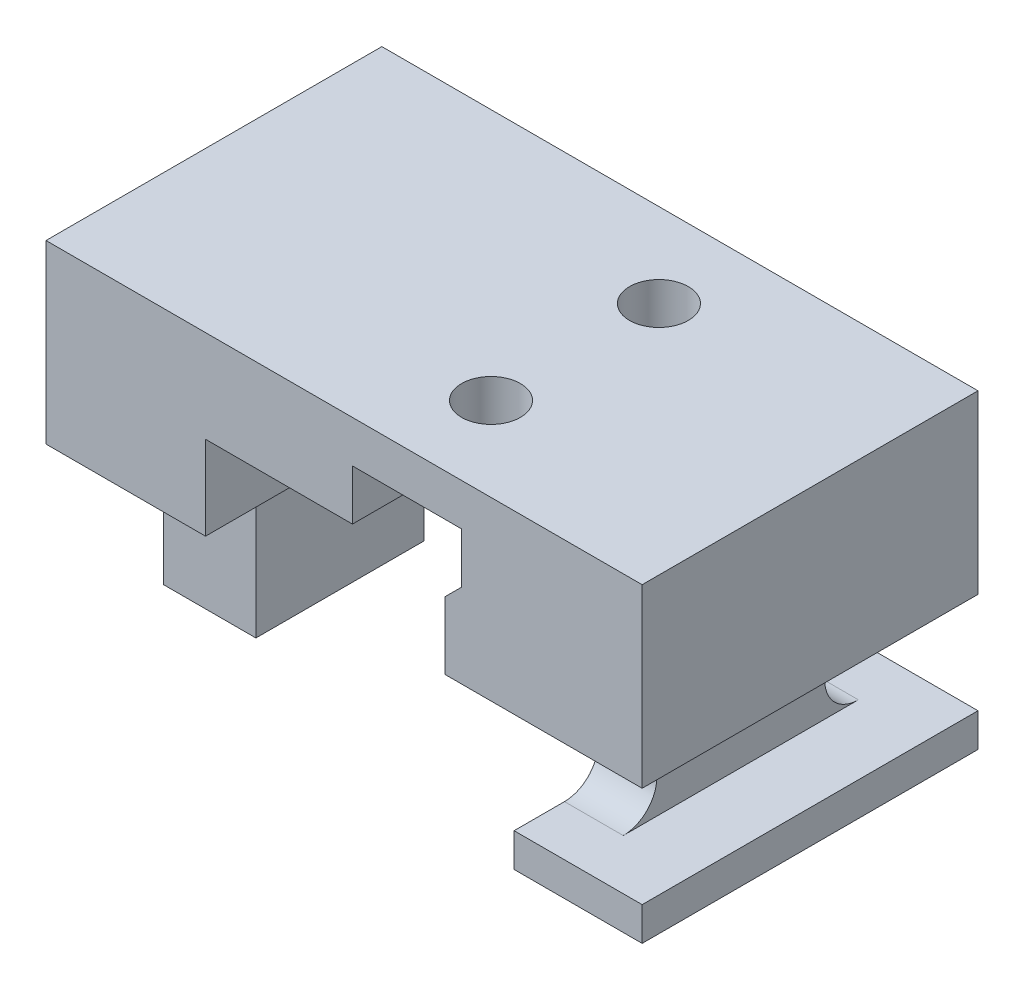
ISO-10303-21;
HEADER;
FILE_DESCRIPTION(('STEP AP214'),'2;1');
FILE_NAME('part.step','',(''),(''),'','','');
FILE_SCHEMA(('AUTOMOTIVE_DESIGN { 1 0 10303 214 1 1 1 1 }'));
ENDSEC;
DATA;
#1=APPLICATION_CONTEXT('core data for automotive mechanical design processes');
#2=APPLICATION_PROTOCOL_DEFINITION('international standard','automotive_design',2000,#1);
#3=PRODUCT_CONTEXT('',#1,'mechanical');
#4=PRODUCT('Part','Part','',(#3));
#5=PRODUCT_RELATED_PRODUCT_CATEGORY('part','',(#4));
#6=PRODUCT_DEFINITION_FORMATION('','',#4);
#7=PRODUCT_DEFINITION_CONTEXT('part definition',#1,'design');
#8=PRODUCT_DEFINITION('design','',#6,#7);
#9=PRODUCT_DEFINITION_SHAPE('','',#8);
#10=(LENGTH_UNIT() NAMED_UNIT(*) SI_UNIT(.MILLI.,.METRE.));
#11=(NAMED_UNIT(*) PLANE_ANGLE_UNIT() SI_UNIT($,.RADIAN.));
#12=(NAMED_UNIT(*) SI_UNIT($,.STERADIAN.) SOLID_ANGLE_UNIT());
#13=UNCERTAINTY_MEASURE_WITH_UNIT(LENGTH_MEASURE(1.E-05),#10,'distance_accuracy_value','');
#14=(GEOMETRIC_REPRESENTATION_CONTEXT(3) GLOBAL_UNCERTAINTY_ASSIGNED_CONTEXT((#13)) GLOBAL_UNIT_ASSIGNED_CONTEXT((#10,
#11,#12)) REPRESENTATION_CONTEXT('',''));
#15=CARTESIAN_POINT('',(0.,0.,0.));
#16=DIRECTION('',(0.,0.,1.));
#17=DIRECTION('',(1.,0.,0.));
#18=AXIS2_PLACEMENT_3D('',#15,#16,#17);
#19=CARTESIAN_POINT('',(-16.75,0.,20.));
#20=DIRECTION('',(1.,0.,0.));
#21=DIRECTION('',(0.,0.,-1.));
#22=AXIS2_PLACEMENT_3D('',#19,#20,#21);
#23=PLANE('',#22);
#24=DIRECTION('',(0.,0.,1.));
#25=VECTOR('',#24,1.);
#26=CARTESIAN_POINT('',(-16.75,-10.5,-10.688779163216));
#27=LINE('',#26,#25);
#28=CARTESIAN_POINT('',(-16.75,-10.5,4.));
#29=VERTEX_POINT('',#28);
#30=CARTESIAN_POINT('',(-16.75,-10.5,16.));
#31=VERTEX_POINT('',#30);
#32=EDGE_CURVE('E304',#29,#31,#27,.T.);
#33=ORIENTED_EDGE('',*,*,#32,.F.);
#34=CARTESIAN_POINT('',(-16.75,-11.5,4.));
#35=DIRECTION('',(1.,0.,0.));
#36=DIRECTION('',(0.,0.,-1.));
#37=AXIS2_PLACEMENT_3D('',#34,#35,#36);
#38=CIRCLE('',#37,1.);
#39=CARTESIAN_POINT('',(-16.75,-11.5,5.));
#40=VERTEX_POINT('',#39);
#41=EDGE_CURVE('E501',#29,#40,#38,.T.);
#42=ORIENTED_EDGE('',*,*,#41,.T.);
#43=DIRECTION('',(0.,1.,0.));
#44=VECTOR('',#43,1.);
#45=CARTESIAN_POINT('',(-16.75,-19.25,5.));
#46=LINE('',#45,#44);
#47=CARTESIAN_POINT('',(-16.75,-19.25,5.));
#48=VERTEX_POINT('',#47);
#49=EDGE_CURVE('E403',#48,#40,#46,.T.);
#50=ORIENTED_EDGE('',*,*,#49,.F.);
#51=DIRECTION('',(0.,0.,-1.));
#52=VECTOR('',#51,1.);
#53=CARTESIAN_POINT('',(-16.75,-19.25,15.));
#54=LINE('',#53,#52);
#55=CARTESIAN_POINT('',(-16.75,-19.25,15.));
#56=VERTEX_POINT('',#55);
#57=EDGE_CURVE('E375',#56,#48,#54,.T.);
#58=ORIENTED_EDGE('',*,*,#57,.F.);
#59=DIRECTION('',(0.,1.,0.));
#60=VECTOR('',#59,1.);
#61=CARTESIAN_POINT('',(-16.75,-19.25,15.));
#62=LINE('',#61,#60);
#63=CARTESIAN_POINT('',(-16.75,-11.5,15.));
#64=VERTEX_POINT('',#63);
#65=EDGE_CURVE('E391',#56,#64,#62,.T.);
#66=ORIENTED_EDGE('',*,*,#65,.T.);
#67=CARTESIAN_POINT('',(-16.75,-11.5,16.));
#68=DIRECTION('',(1.,0.,0.));
#69=DIRECTION('',(0.,0.,-1.));
#70=AXIS2_PLACEMENT_3D('',#67,#68,#69);
#71=CIRCLE('',#70,1.);
#72=EDGE_CURVE('E504',#64,#31,#71,.T.);
#73=ORIENTED_EDGE('',*,*,#72,.T.);
#74=EDGE_LOOP('',(#33,#42,#50,#58,#66,#73));
#75=FACE_BOUND('',#74,.T.);
#76=ADVANCED_FACE('F41',(#75),#23,.F.);
#77=CARTESIAN_POINT('',(5.00000000000001,-10.5,20.));
#78=DIRECTION('',(0.,1.,0.));
#79=DIRECTION('',(0.,0.,1.));
#80=AXIS2_PLACEMENT_3D('',#77,#78,#79);
#81=PLANE('',#80);
#82=DIRECTION('',(1.,0.,0.));
#83=VECTOR('',#82,1.);
#84=CARTESIAN_POINT('',(5.00000000000001,-10.5,0.));
#85=LINE('',#84,#83);
#86=CARTESIAN_POINT('',(5.00000000000001,-10.5,0.));
#87=VERTEX_POINT('',#86);
#88=CARTESIAN_POINT('',(16.75,-10.5,0.));
#89=VERTEX_POINT('',#88);
#90=EDGE_CURVE('E446',#87,#89,#85,.T.);
#91=ORIENTED_EDGE('',*,*,#90,.T.);
#92=DIRECTION('',(0.,0.,-1.));
#93=VECTOR('',#92,1.);
#94=CARTESIAN_POINT('',(16.75,-10.5,20.));
#95=LINE('',#94,#93);
#96=CARTESIAN_POINT('',(16.75,-10.5,20.));
#97=VERTEX_POINT('',#96);
#98=EDGE_CURVE('E459',#97,#89,#95,.T.);
#99=ORIENTED_EDGE('',*,*,#98,.F.);
#100=DIRECTION('',(1.,0.,0.));
#101=VECTOR('',#100,1.);
#102=CARTESIAN_POINT('',(5.00000000000001,-10.5,20.));
#103=LINE('',#102,#101);
#104=CARTESIAN_POINT('',(5.00000000000001,-10.5,20.));
#105=VERTEX_POINT('',#104);
#106=EDGE_CURVE('E426',#105,#97,#103,.T.);
#107=ORIENTED_EDGE('',*,*,#106,.F.);
#108=DIRECTION('',(0.,0.,-1.));
#109=VECTOR('',#108,1.);
#110=CARTESIAN_POINT('',(5.00000000000001,-10.5,20.));
#111=LINE('',#110,#109);
#112=EDGE_CURVE('E462',#105,#87,#111,.T.);
#113=ORIENTED_EDGE('',*,*,#112,.T.);
#114=EDGE_LOOP('',(#91,#99,#107,#113));
#115=FACE_BOUND('',#114,.T.);
#116=DIRECTION('',(-1.,0.,0.));
#117=VECTOR('',#116,1.);
#118=CARTESIAN_POINT('',(9.12499999999999,-10.5,4.));
#119=LINE('',#118,#117);
#120=CARTESIAN_POINT('',(12.625,-10.5,4.));
#121=VERTEX_POINT('',#120);
#122=CARTESIAN_POINT('',(9.12499999999999,-10.5,4.));
#123=VERTEX_POINT('',#122);
#124=EDGE_CURVE('E486',#121,#123,#119,.T.);
#125=ORIENTED_EDGE('',*,*,#124,.T.);
#126=DIRECTION('',(0.,0.,1.));
#127=VECTOR('',#126,1.);
#128=CARTESIAN_POINT('',(9.12499999999999,-10.5,5.));
#129=LINE('',#128,#127);
#130=CARTESIAN_POINT('',(9.12499999999999,-10.5,16.));
#131=VERTEX_POINT('',#130);
#132=EDGE_CURVE('E362',#123,#131,#129,.T.);
#133=ORIENTED_EDGE('',*,*,#132,.T.);
#134=DIRECTION('',(-1.,0.,0.));
#135=VECTOR('',#134,1.);
#136=CARTESIAN_POINT('',(5.00000000000001,-10.5,16.));
#137=LINE('',#136,#135);
#138=CARTESIAN_POINT('',(12.625,-10.5,16.));
#139=VERTEX_POINT('',#138);
#140=EDGE_CURVE('E482',#131,#139,#137,.F.);
#141=ORIENTED_EDGE('',*,*,#140,.T.);
#142=DIRECTION('',(0.,0.,1.));
#143=VECTOR('',#142,1.);
#144=CARTESIAN_POINT('',(12.625,-10.5,5.));
#145=LINE('',#144,#143);
#146=EDGE_CURVE('E366',#121,#139,#145,.T.);
#147=ORIENTED_EDGE('',*,*,#146,.F.);
#148=EDGE_LOOP('',(#125,#133,#141,#147));
#149=FACE_BOUND('',#148,.T.);
#150=ADVANCED_FACE('F589',(#115,#149),#81,.F.);
#151=CARTESIAN_POINT('',(-16.75,-10.5,20.));
#152=DIRECTION('',(0.,1.,0.));
#153=DIRECTION('',(0.,0.,1.));
#154=AXIS2_PLACEMENT_3D('',#151,#152,#153);
#155=PLANE('',#154);
#156=DIRECTION('',(1.,0.,0.));
#157=VECTOR('',#156,1.);
#158=CARTESIAN_POINT('',(-16.75,-10.5,0.));
#159=LINE('',#158,#157);
#160=CARTESIAN_POINT('',(-18.75,-10.5,0.));
#161=VERTEX_POINT('',#160);
#162=CARTESIAN_POINT('',(-9.25,-10.5,0.));
#163=VERTEX_POINT('',#162);
#164=EDGE_CURVE('E415',#161,#163,#159,.T.);
#165=ORIENTED_EDGE('',*,*,#164,.T.);
#166=DIRECTION('',(0.,0.,1.));
#167=VECTOR('',#166,1.);
#168=CARTESIAN_POINT('',(-9.25,-10.5,20.));
#169=LINE('',#168,#167);
#170=CARTESIAN_POINT('',(-9.25,-10.5,20.));
#171=VERTEX_POINT('',#170);
#172=EDGE_CURVE('E272',#163,#171,#169,.T.);
#173=ORIENTED_EDGE('',*,*,#172,.T.);
#174=DIRECTION('',(1.,0.,0.));
#175=VECTOR('',#174,1.);
#176=CARTESIAN_POINT('',(-16.75,-10.5,20.));
#177=LINE('',#176,#175);
#178=CARTESIAN_POINT('',(-18.75,-10.5,20.));
#179=VERTEX_POINT('',#178);
#180=EDGE_CURVE('E416',#179,#171,#177,.T.);
#181=ORIENTED_EDGE('',*,*,#180,.F.);
#182=DIRECTION('',(0.,0.,1.));
#183=VECTOR('',#182,1.);
#184=CARTESIAN_POINT('',(-18.75,-10.5,-10.688779163216));
#185=LINE('',#184,#183);
#186=EDGE_CURVE('E299',#161,#179,#185,.T.);
#187=ORIENTED_EDGE('',*,*,#186,.F.);
#188=EDGE_LOOP('',(#165,#173,#181,#187));
#189=FACE_BOUND('',#188,.T.);
#190=DIRECTION('',(0.,0.,-1.));
#191=VECTOR('',#190,1.);
#192=CARTESIAN_POINT('',(-11.25,-10.5,20.));
#193=LINE('',#192,#191);
#194=CARTESIAN_POINT('',(-11.25,-10.5,16.));
#195=VERTEX_POINT('',#194);
#196=CARTESIAN_POINT('',(-11.25,-10.5,4.));
#197=VERTEX_POINT('',#196);
#198=EDGE_CURVE('E267',#195,#197,#193,.T.);
#199=ORIENTED_EDGE('',*,*,#198,.T.);
#200=DIRECTION('',(1.,0.,0.));
#201=VECTOR('',#200,1.);
#202=CARTESIAN_POINT('',(-16.75,-10.5,4.));
#203=LINE('',#202,#201);
#204=EDGE_CURVE('E470',#197,#29,#203,.F.);
#205=ORIENTED_EDGE('',*,*,#204,.T.);
#206=ORIENTED_EDGE('',*,*,#32,.T.);
#207=DIRECTION('',(-1.,0.,0.));
#208=VECTOR('',#207,1.);
#209=CARTESIAN_POINT('',(-11.25,-10.5,16.));
#210=LINE('',#209,#208);
#211=EDGE_CURVE('E478',#31,#195,#210,.F.);
#212=ORIENTED_EDGE('',*,*,#211,.T.);
#213=EDGE_LOOP('',(#199,#205,#206,#212));
#214=FACE_BOUND('',#213,.T.);
#215=ADVANCED_FACE('F638',(#189,#214),#155,.F.);
#216=CARTESIAN_POINT('',(-11.25,-10.5,20.));
#217=DIRECTION('',(-1.,0.,0.));
#218=DIRECTION('',(0.,0.,1.));
#219=AXIS2_PLACEMENT_3D('',#216,#217,#218);
#220=PLANE('',#219);
#221=CARTESIAN_POINT('',(-11.25,-11.5,4.));
#222=DIRECTION('',(-1.,0.,0.));
#223=DIRECTION('',(0.,0.,1.));
#224=AXIS2_PLACEMENT_3D('',#221,#222,#223);
#225=CIRCLE('',#224,1.);
#226=CARTESIAN_POINT('',(-11.25,-11.5,5.));
#227=VERTEX_POINT('',#226);
#228=EDGE_CURVE('E498',#227,#197,#225,.T.);
#229=ORIENTED_EDGE('',*,*,#228,.T.);
#230=ORIENTED_EDGE('',*,*,#198,.F.);
#231=CARTESIAN_POINT('',(-11.25,-11.5,16.));
#232=DIRECTION('',(-1.,0.,0.));
#233=DIRECTION('',(0.,0.,1.));
#234=AXIS2_PLACEMENT_3D('',#231,#232,#233);
#235=CIRCLE('',#234,1.);
#236=CARTESIAN_POINT('',(-11.25,-11.5,15.));
#237=VERTEX_POINT('',#236);
#238=EDGE_CURVE('E508',#195,#237,#235,.T.);
#239=ORIENTED_EDGE('',*,*,#238,.T.);
#240=DIRECTION('',(0.,1.,0.));
#241=VECTOR('',#240,1.);
#242=CARTESIAN_POINT('',(-11.25,-19.25,15.));
#243=LINE('',#242,#241);
#244=CARTESIAN_POINT('',(-11.25,-19.25,15.));
#245=VERTEX_POINT('',#244);
#246=EDGE_CURVE('E395',#245,#237,#243,.T.);
#247=ORIENTED_EDGE('',*,*,#246,.F.);
#248=DIRECTION('',(0.,0.,1.));
#249=VECTOR('',#248,1.);
#250=CARTESIAN_POINT('',(-11.25,-19.25,15.));
#251=LINE('',#250,#249);
#252=CARTESIAN_POINT('',(-11.25,-19.25,5.));
#253=VERTEX_POINT('',#252);
#254=EDGE_CURVE('E385',#253,#245,#251,.T.);
#255=ORIENTED_EDGE('',*,*,#254,.F.);
#256=DIRECTION('',(0.,1.,0.));
#257=VECTOR('',#256,1.);
#258=CARTESIAN_POINT('',(-11.25,-19.25,5.));
#259=LINE('',#258,#257);
#260=EDGE_CURVE('E399',#253,#227,#259,.T.);
#261=ORIENTED_EDGE('',*,*,#260,.T.);
#262=EDGE_LOOP('',(#229,#230,#239,#247,#255,#261));
#263=FACE_BOUND('',#262,.T.);
#264=ADVANCED_FACE('F757',(#263),#220,.F.);
#265=CARTESIAN_POINT('',(-11.25,-5.5,20.));
#266=DIRECTION('',(0.,1.,0.));
#267=DIRECTION('',(0.,0.,1.));
#268=AXIS2_PLACEMENT_3D('',#265,#266,#267);
#269=PLANE('',#268);
#270=DIRECTION('',(1.,0.,0.));
#271=VECTOR('',#270,1.);
#272=CARTESIAN_POINT('',(-11.25,-5.5,20.));
#273=LINE('',#272,#271);
#274=CARTESIAN_POINT('',(-9.25,-5.5,20.));
#275=VERTEX_POINT('',#274);
#276=CARTESIAN_POINT('',(-0.500000000000008,-5.5,20.));
#277=VERTEX_POINT('',#276);
#278=EDGE_CURVE('E419',#275,#277,#273,.T.);
#279=ORIENTED_EDGE('',*,*,#278,.F.);
#280=DIRECTION('',(0.,0.,1.));
#281=VECTOR('',#280,1.);
#282=CARTESIAN_POINT('',(-9.25,-5.49999999999999,20.));
#283=LINE('',#282,#281);
#284=CARTESIAN_POINT('',(-9.25,-5.5,0.));
#285=VERTEX_POINT('',#284);
#286=EDGE_CURVE('E282',#285,#275,#283,.T.);
#287=ORIENTED_EDGE('',*,*,#286,.F.);
#288=DIRECTION('',(1.,0.,0.));
#289=VECTOR('',#288,1.);
#290=CARTESIAN_POINT('',(-11.25,-5.5,0.));
#291=LINE('',#290,#289);
#292=CARTESIAN_POINT('',(-0.500000000000008,-5.5,0.));
#293=VERTEX_POINT('',#292);
#294=EDGE_CURVE('E440',#285,#293,#291,.T.);
#295=ORIENTED_EDGE('',*,*,#294,.T.);
#296=DIRECTION('',(0.,0.,1.));
#297=VECTOR('',#296,1.);
#298=CARTESIAN_POINT('',(-0.500000000000008,-5.5,-10.));
#299=LINE('',#298,#297);
#300=EDGE_CURVE('E326',#293,#277,#299,.T.);
#301=ORIENTED_EDGE('',*,*,#300,.T.);
#302=EDGE_LOOP('',(#279,#287,#295,#301));
#303=FACE_BOUND('',#302,.T.);
#304=ADVANCED_FACE('F751',(#303),#269,.F.);
#305=CARTESIAN_POINT('',(5.00000000000001,-5.49999999999999,20.));
#306=DIRECTION('',(1.,0.,0.));
#307=DIRECTION('',(0.,1.,0.));
#308=AXIS2_PLACEMENT_3D('',#305,#306,#307);
#309=PLANE('',#308);
#310=DIRECTION('',(0.,-1.,0.));
#311=VECTOR('',#310,1.);
#312=CARTESIAN_POINT('',(4.99999999999999,-3.49999999999999,20.));
#313=LINE('',#312,#311);
#314=CARTESIAN_POINT('',(5.00000000000002,-6.5,20.));
#315=VERTEX_POINT('',#314);
#316=EDGE_CURVE('E423',#315,#105,#313,.T.);
#317=ORIENTED_EDGE('',*,*,#316,.F.);
#318=DIRECTION('',(0.,0.,-1.));
#319=VECTOR('',#318,1.);
#320=CARTESIAN_POINT('',(5.00000000000001,-6.5,20.));
#321=LINE('',#320,#319);
#322=CARTESIAN_POINT('',(5.00000000000001,-6.5,0.));
#323=VERTEX_POINT('',#322);
#324=EDGE_CURVE('E537',#315,#323,#321,.T.);
#325=ORIENTED_EDGE('',*,*,#324,.T.);
#326=DIRECTION('',(0.,-1.,0.));
#327=VECTOR('',#326,1.);
#328=CARTESIAN_POINT('',(5.00000000000001,-5.49999999999999,0.));
#329=LINE('',#328,#327);
#330=EDGE_CURVE('E443',#323,#87,#329,.T.);
#331=ORIENTED_EDGE('',*,*,#330,.T.);
#332=ORIENTED_EDGE('',*,*,#112,.F.);
#333=EDGE_LOOP('',(#317,#325,#331,#332));
#334=FACE_BOUND('',#333,.T.);
#335=ADVANCED_FACE('F756',(#334),#309,.F.);
#336=CARTESIAN_POINT('',(16.75,0.,20.));
#337=DIRECTION('',(1.,0.,0.));
#338=DIRECTION('',(0.,0.,-1.));
#339=AXIS2_PLACEMENT_3D('',#336,#337,#338);
#340=PLANE('',#339);
#341=DIRECTION('',(0.,-1.,0.));
#342=VECTOR('',#341,1.);
#343=CARTESIAN_POINT('',(16.75,0.,0.));
#344=LINE('',#343,#342);
#345=CARTESIAN_POINT('',(16.75,0.,0.));
#346=VERTEX_POINT('',#345);
#347=EDGE_CURVE('E450',#346,#89,#344,.T.);
#348=ORIENTED_EDGE('',*,*,#347,.F.);
#349=DIRECTION('',(0.,0.,-1.));
#350=VECTOR('',#349,1.);
#351=CARTESIAN_POINT('',(16.75,0.,20.));
#352=LINE('',#351,#350);
#353=CARTESIAN_POINT('',(16.75,0.,20.));
#354=VERTEX_POINT('',#353);
#355=EDGE_CURVE('E437',#354,#346,#352,.T.);
#356=ORIENTED_EDGE('',*,*,#355,.F.);
#357=DIRECTION('',(0.,-1.,0.));
#358=VECTOR('',#357,1.);
#359=CARTESIAN_POINT('',(16.75,0.,20.));
#360=LINE('',#359,#358);
#361=EDGE_CURVE('E429',#354,#97,#360,.T.);
#362=ORIENTED_EDGE('',*,*,#361,.T.);
#363=ORIENTED_EDGE('',*,*,#98,.T.);
#364=EDGE_LOOP('',(#348,#356,#362,#363));
#365=FACE_BOUND('',#364,.T.);
#366=ADVANCED_FACE('F794',(#365),#340,.T.);
#367=CARTESIAN_POINT('',(-16.75,0.,20.));
#368=DIRECTION('',(0.,1.,0.));
#369=DIRECTION('',(0.,0.,1.));
#370=AXIS2_PLACEMENT_3D('',#367,#368,#369);
#371=PLANE('',#370);
#372=CARTESIAN_POINT('',(2.74999999999999,0.,5.));
#373=DIRECTION('',(0.,1.,0.));
#374=DIRECTION('',(0.,0.,1.));
#375=AXIS2_PLACEMENT_3D('',#372,#373,#374);
#376=CIRCLE('',#375,1.75);
#377=CARTESIAN_POINT('',(2.74999999999999,0.,6.75));
#378=VERTEX_POINT('',#377);
#379=EDGE_CURVE('E407',#378,#378,#376,.F.);
#380=ORIENTED_EDGE('',*,*,#379,.T.);
#381=EDGE_LOOP('',(#380));
#382=FACE_BOUND('',#381,.T.);
#383=CARTESIAN_POINT('',(2.74999999999999,0.,15.));
#384=DIRECTION('',(0.,1.,0.));
#385=DIRECTION('',(0.,0.,1.));
#386=AXIS2_PLACEMENT_3D('',#383,#384,#385);
#387=CIRCLE('',#386,1.75);
#388=CARTESIAN_POINT('',(2.74999999999999,0.,16.75));
#389=VERTEX_POINT('',#388);
#390=EDGE_CURVE('E411',#389,#389,#387,.F.);
#391=ORIENTED_EDGE('',*,*,#390,.T.);
#392=EDGE_LOOP('',(#391));
#393=FACE_BOUND('',#392,.T.);
#394=DIRECTION('',(1.,0.,0.));
#395=VECTOR('',#394,1.);
#396=CARTESIAN_POINT('',(-16.75,0.,0.));
#397=LINE('',#396,#395);
#398=CARTESIAN_POINT('',(-18.75,0.,0.));
#399=VERTEX_POINT('',#398);
#400=EDGE_CURVE('E420',#399,#346,#397,.T.);
#401=ORIENTED_EDGE('',*,*,#400,.F.);
#402=DIRECTION('',(0.,0.,1.));
#403=VECTOR('',#402,1.);
#404=CARTESIAN_POINT('',(-18.75,0.,-10.688779163216));
#405=LINE('',#404,#403);
#406=CARTESIAN_POINT('',(-18.75,0.,20.));
#407=VERTEX_POINT('',#406);
#408=EDGE_CURVE('E303',#399,#407,#405,.T.);
#409=ORIENTED_EDGE('',*,*,#408,.T.);
#410=DIRECTION('',(1.,0.,0.));
#411=VECTOR('',#410,1.);
#412=CARTESIAN_POINT('',(-16.75,0.,20.));
#413=LINE('',#412,#411);
#414=EDGE_CURVE('E433',#407,#354,#413,.T.);
#415=ORIENTED_EDGE('',*,*,#414,.T.);
#416=ORIENTED_EDGE('',*,*,#355,.T.);
#417=EDGE_LOOP('',(#401,#409,#415,#416));
#418=FACE_BOUND('',#417,.T.);
#419=ADVANCED_FACE('F742',(#382,#393,#418),#371,.T.);
#420=CARTESIAN_POINT('',(0.,0.,20.));
#421=DIRECTION('',(0.,0.,1.));
#422=DIRECTION('',(1.,0.,0.));
#423=AXIS2_PLACEMENT_3D('',#420,#421,#422);
#424=PLANE('',#423);
#425=DIRECTION('',(0.,-1.,0.));
#426=VECTOR('',#425,1.);
#427=CARTESIAN_POINT('',(-9.25,14.5997512422418,20.));
#428=LINE('',#427,#426);
#429=EDGE_CURVE('E286',#275,#171,#428,.T.);
#430=ORIENTED_EDGE('',*,*,#429,.F.);
#431=ORIENTED_EDGE('',*,*,#278,.T.);
#432=DIRECTION('',(0.,-1.,0.));
#433=VECTOR('',#432,1.);
#434=CARTESIAN_POINT('',(-0.500000000000008,-2.5,20.));
#435=LINE('',#434,#433);
#436=CARTESIAN_POINT('',(-0.500000000000008,-2.5,20.));
#437=VERTEX_POINT('',#436);
#438=EDGE_CURVE('E298',#437,#277,#435,.T.);
#439=ORIENTED_EDGE('',*,*,#438,.F.);
#440=DIRECTION('',(-1.,0.,0.));
#441=VECTOR('',#440,1.);
#442=CARTESIAN_POINT('',(-0.500000000000008,-2.5,20.));
#443=LINE('',#442,#441);
#444=CARTESIAN_POINT('',(5.99999999999999,-2.5,20.));
#445=VERTEX_POINT('',#444);
#446=EDGE_CURVE('E322',#445,#437,#443,.T.);
#447=ORIENTED_EDGE('',*,*,#446,.F.);
#448=DIRECTION('',(0.,1.,0.));
#449=VECTOR('',#448,1.);
#450=CARTESIAN_POINT('',(5.99999999999999,-2.5,20.));
#451=LINE('',#450,#449);
#452=CARTESIAN_POINT('',(5.99999999999999,-5.5,20.));
#453=VERTEX_POINT('',#452);
#454=EDGE_CURVE('E318',#453,#445,#451,.T.);
#455=ORIENTED_EDGE('',*,*,#454,.F.);
#456=DIRECTION('',(0.707106781186547,0.707106781186548,0.));
#457=VECTOR('',#456,1.);
#458=CARTESIAN_POINT('',(5.75000000000001,-5.75,20.));
#459=LINE('',#458,#457);
#460=EDGE_CURVE('E308',#453,#315,#459,.F.);
#461=ORIENTED_EDGE('',*,*,#460,.T.);
#462=ORIENTED_EDGE('',*,*,#316,.T.);
#463=ORIENTED_EDGE('',*,*,#106,.T.);
#464=ORIENTED_EDGE('',*,*,#361,.F.);
#465=ORIENTED_EDGE('',*,*,#414,.F.);
#466=DIRECTION('',(0.,-1.,0.));
#467=VECTOR('',#466,1.);
#468=CARTESIAN_POINT('',(-18.75,-10.5,20.));
#469=LINE('',#468,#467);
#470=EDGE_CURVE('E290',#407,#179,#469,.T.);
#471=ORIENTED_EDGE('',*,*,#470,.T.);
#472=ORIENTED_EDGE('',*,*,#180,.T.);
#473=EDGE_LOOP('',(#430,#431,#439,#447,#455,#461,#462,#463,#464,#465,#471,#472));
#474=FACE_BOUND('',#473,.T.);
#475=ADVANCED_FACE('F730',(#474),#424,.T.);
#476=CARTESIAN_POINT('',(0.,0.,0.));
#477=DIRECTION('',(0.,0.,1.));
#478=DIRECTION('',(1.,0.,0.));
#479=AXIS2_PLACEMENT_3D('',#476,#477,#478);
#480=PLANE('',#479);
#481=ORIENTED_EDGE('',*,*,#294,.F.);
#482=DIRECTION('',(0.,-1.,0.));
#483=VECTOR('',#482,1.);
#484=CARTESIAN_POINT('',(-9.25,14.5997512422418,0.));
#485=LINE('',#484,#483);
#486=EDGE_CURVE('E280',#285,#163,#485,.T.);
#487=ORIENTED_EDGE('',*,*,#486,.T.);
#488=ORIENTED_EDGE('',*,*,#164,.F.);
#489=DIRECTION('',(0.,1.,0.));
#490=VECTOR('',#489,1.);
#491=CARTESIAN_POINT('',(-18.75,-10.5,0.));
#492=LINE('',#491,#490);
#493=EDGE_CURVE('E294',#161,#399,#492,.T.);
#494=ORIENTED_EDGE('',*,*,#493,.T.);
#495=ORIENTED_EDGE('',*,*,#400,.T.);
#496=ORIENTED_EDGE('',*,*,#347,.T.);
#497=ORIENTED_EDGE('',*,*,#90,.F.);
#498=ORIENTED_EDGE('',*,*,#330,.F.);
#499=DIRECTION('',(-0.707106781186547,-0.707106781186548,0.));
#500=VECTOR('',#499,1.);
#501=CARTESIAN_POINT('',(5.00000000000001,-6.5,0.));
#502=LINE('',#501,#500);
#503=CARTESIAN_POINT('',(5.99999999999999,-5.5,0.));
#504=VERTEX_POINT('',#503);
#505=EDGE_CURVE('E541',#323,#504,#502,.F.);
#506=ORIENTED_EDGE('',*,*,#505,.T.);
#507=DIRECTION('',(0.,1.,0.));
#508=VECTOR('',#507,1.);
#509=CARTESIAN_POINT('',(5.99999999999999,0.,0.));
#510=LINE('',#509,#508);
#511=CARTESIAN_POINT('',(5.99999999999999,-2.5,0.));
#512=VERTEX_POINT('',#511);
#513=EDGE_CURVE('E526',#504,#512,#510,.T.);
#514=ORIENTED_EDGE('',*,*,#513,.T.);
#515=DIRECTION('',(-1.,0.,0.));
#516=VECTOR('',#515,1.);
#517=CARTESIAN_POINT('',(0.,-2.5,0.));
#518=LINE('',#517,#516);
#519=CARTESIAN_POINT('',(-0.500000000000008,-2.5,0.));
#520=VERTEX_POINT('',#519);
#521=EDGE_CURVE('E344',#512,#520,#518,.T.);
#522=ORIENTED_EDGE('',*,*,#521,.T.);
#523=DIRECTION('',(0.,-1.,0.));
#524=VECTOR('',#523,1.);
#525=CARTESIAN_POINT('',(-0.500000000000009,0.,0.));
#526=LINE('',#525,#524);
#527=EDGE_CURVE('E533',#520,#293,#526,.T.);
#528=ORIENTED_EDGE('',*,*,#527,.T.);
#529=EDGE_LOOP('',(#481,#487,#488,#494,#495,#496,#497,#498,#506,#514,#522,#528));
#530=FACE_BOUND('',#529,.T.);
#531=ADVANCED_FACE('F725',(#530),#480,.F.);
#532=CARTESIAN_POINT('',(2.74999999999999,4.94974746830583,15.));
#533=DIRECTION('',(0.,-1.,0.));
#534=DIRECTION('',(1.,0.,0.));
#535=AXIS2_PLACEMENT_3D('',#532,#533,#534);
#536=CYLINDRICAL_SURFACE('',#535,1.75);
#537=CARTESIAN_POINT('',(2.74999999999999,-2.5,15.));
#538=DIRECTION('',(0.,1.,0.));
#539=DIRECTION('',(0.,0.,1.));
#540=AXIS2_PLACEMENT_3D('',#537,#538,#539);
#541=CIRCLE('',#540,1.75);
#542=CARTESIAN_POINT('',(2.74999999999999,-2.5,16.75));
#543=VERTEX_POINT('',#542);
#544=EDGE_CURVE('E340',#543,#543,#541,.F.);
#545=ORIENTED_EDGE('',*,*,#544,.T.);
#546=EDGE_LOOP('',(#545));
#547=FACE_BOUND('',#546,.T.);
#548=ORIENTED_EDGE('',*,*,#390,.F.);
#549=EDGE_LOOP('',(#548));
#550=FACE_BOUND('',#549,.T.);
#551=ADVANCED_FACE('F729',(#547,#550),#536,.F.);
#552=CARTESIAN_POINT('',(2.74999999999999,4.94974746830583,5.));
#553=DIRECTION('',(0.,-1.,0.));
#554=DIRECTION('',(1.,0.,0.));
#555=AXIS2_PLACEMENT_3D('',#552,#553,#554);
#556=CYLINDRICAL_SURFACE('',#555,1.75);
#557=CARTESIAN_POINT('',(2.75,-2.5,5.));
#558=DIRECTION('',(0.,1.,0.));
#559=DIRECTION('',(0.,0.,1.));
#560=AXIS2_PLACEMENT_3D('',#557,#558,#559);
#561=CIRCLE('',#560,1.75);
#562=CARTESIAN_POINT('',(2.75,-2.5,6.75));
#563=VERTEX_POINT('',#562);
#564=EDGE_CURVE('E330',#563,#563,#561,.F.);
#565=ORIENTED_EDGE('',*,*,#564,.T.);
#566=EDGE_LOOP('',(#565));
#567=FACE_BOUND('',#566,.T.);
#568=ORIENTED_EDGE('',*,*,#379,.F.);
#569=EDGE_LOOP('',(#568));
#570=FACE_BOUND('',#569,.T.);
#571=ADVANCED_FACE('F852',(#567,#570),#556,.F.);
#572=CARTESIAN_POINT('',(-16.75,-19.25,5.));
#573=DIRECTION('',(0.,0.,1.));
#574=DIRECTION('',(1.,0.,0.));
#575=AXIS2_PLACEMENT_3D('',#572,#573,#574);
#576=PLANE('',#575);
#577=ORIENTED_EDGE('',*,*,#49,.T.);
#578=DIRECTION('',(1.,0.,0.));
#579=VECTOR('',#578,1.);
#580=CARTESIAN_POINT('',(-11.25,-11.5,5.));
#581=LINE('',#580,#579);
#582=EDGE_CURVE('E466',#40,#227,#581,.T.);
#583=ORIENTED_EDGE('',*,*,#582,.T.);
#584=ORIENTED_EDGE('',*,*,#260,.F.);
#585=DIRECTION('',(1.,0.,0.));
#586=VECTOR('',#585,1.);
#587=CARTESIAN_POINT('',(-16.75,-19.25,5.));
#588=LINE('',#587,#586);
#589=EDGE_CURVE('E382',#48,#253,#588,.T.);
#590=ORIENTED_EDGE('',*,*,#589,.F.);
#591=EDGE_LOOP('',(#577,#583,#584,#590));
#592=FACE_BOUND('',#591,.T.);
#593=ADVANCED_FACE('F857',(#592),#576,.F.);
#594=CARTESIAN_POINT('',(-16.75,-19.25,15.));
#595=DIRECTION('',(0.,0.,-1.));
#596=DIRECTION('',(-1.,0.,0.));
#597=AXIS2_PLACEMENT_3D('',#594,#595,#596);
#598=PLANE('',#597);
#599=ORIENTED_EDGE('',*,*,#246,.T.);
#600=DIRECTION('',(-1.,0.,0.));
#601=VECTOR('',#600,1.);
#602=CARTESIAN_POINT('',(-16.75,-11.5,15.));
#603=LINE('',#602,#601);
#604=EDGE_CURVE('E474',#237,#64,#603,.T.);
#605=ORIENTED_EDGE('',*,*,#604,.T.);
#606=ORIENTED_EDGE('',*,*,#65,.F.);
#607=DIRECTION('',(-1.,0.,0.));
#608=VECTOR('',#607,1.);
#609=CARTESIAN_POINT('',(-16.75,-19.25,15.));
#610=LINE('',#609,#608);
#611=EDGE_CURVE('E388',#245,#56,#610,.T.);
#612=ORIENTED_EDGE('',*,*,#611,.F.);
#613=EDGE_LOOP('',(#599,#605,#606,#612));
#614=FACE_BOUND('',#613,.T.);
#615=ADVANCED_FACE('F883',(#614),#598,.F.);
#616=CARTESIAN_POINT('',(0.,-19.25,0.));
#617=DIRECTION('',(0.,-1.,0.));
#618=DIRECTION('',(1.,0.,0.));
#619=AXIS2_PLACEMENT_3D('',#616,#617,#618);
#620=PLANE('',#619);
#621=CARTESIAN_POINT('',(-14.,-19.25,10.));
#622=DIRECTION('',(0.,-1.,0.));
#623=DIRECTION('',(1.,0.,0.));
#624=AXIS2_PLACEMENT_3D('',#621,#622,#623);
#625=CIRCLE('',#624,0.875);
#626=CARTESIAN_POINT('',(-13.125,-19.25,10.));
#627=VERTEX_POINT('',#626);
#628=EDGE_CURVE('E365',#627,#627,#625,.T.);
#629=ORIENTED_EDGE('',*,*,#628,.F.);
#630=EDGE_LOOP('',(#629));
#631=FACE_BOUND('',#630,.T.);
#632=ORIENTED_EDGE('',*,*,#57,.T.);
#633=ORIENTED_EDGE('',*,*,#589,.T.);
#634=ORIENTED_EDGE('',*,*,#254,.T.);
#635=ORIENTED_EDGE('',*,*,#611,.T.);
#636=EDGE_LOOP('',(#632,#633,#634,#635));
#637=FACE_BOUND('',#636,.T.);
#638=ADVANCED_FACE('F888',(#631,#637),#620,.T.);
#639=CARTESIAN_POINT('',(-14.,-9.24999999999999,10.));
#640=DIRECTION('',(0.,-1.,0.));
#641=DIRECTION('',(1.,0.,0.));
#642=AXIS2_PLACEMENT_3D('',#639,#640,#641);
#643=CYLINDRICAL_SURFACE('',#642,0.875);
#644=CARTESIAN_POINT('',(-14.,-9.24999999999999,10.));
#645=DIRECTION('',(0.,-1.,0.));
#646=DIRECTION('',(1.,0.,0.));
#647=AXIS2_PLACEMENT_3D('',#644,#645,#646);
#648=CIRCLE('',#647,0.875);
#649=CARTESIAN_POINT('',(-13.125,-9.24999999999999,10.));
#650=VERTEX_POINT('',#649);
#651=EDGE_CURVE('E371',#650,#650,#648,.T.);
#652=ORIENTED_EDGE('',*,*,#651,.F.);
#653=EDGE_LOOP('',(#652));
#654=FACE_BOUND('',#653,.T.);
#655=ORIENTED_EDGE('',*,*,#628,.T.);
#656=EDGE_LOOP('',(#655));
#657=FACE_BOUND('',#656,.T.);
#658=ADVANCED_FACE('F915',(#654,#657),#643,.F.);
#659=CARTESIAN_POINT('',(-14.,-9.24999999999999,10.));
#660=DIRECTION('',(0.,-1.,0.));
#661=DIRECTION('',(1.,0.,0.));
#662=AXIS2_PLACEMENT_3D('',#659,#660,#661);
#663=PLANE('',#662);
#664=ORIENTED_EDGE('',*,*,#651,.T.);
#665=EDGE_LOOP('',(#664));
#666=FACE_BOUND('',#665,.T.);
#667=ADVANCED_FACE('F911',(#666),#663,.T.);
#668=CARTESIAN_POINT('',(9.12499999999999,-10.5,5.));
#669=DIRECTION('',(-1.,0.,0.));
#670=DIRECTION('',(0.,0.,1.));
#671=AXIS2_PLACEMENT_3D('',#668,#669,#670);
#672=PLANE('',#671);
#673=DIRECTION('',(0.,-1.,0.));
#674=VECTOR('',#673,1.);
#675=CARTESIAN_POINT('',(9.12499999999999,-10.5,15.));
#676=LINE('',#675,#674);
#677=CARTESIAN_POINT('',(9.12499999999999,-11.5,15.));
#678=VERTEX_POINT('',#677);
#679=CARTESIAN_POINT('',(9.12499999999999,-14.5,15.));
#680=VERTEX_POINT('',#679);
#681=EDGE_CURVE('E348',#678,#680,#676,.T.);
#682=ORIENTED_EDGE('',*,*,#681,.F.);
#683=CARTESIAN_POINT('',(9.12499999999999,-11.5,16.));
#684=DIRECTION('',(-1.,0.,0.));
#685=DIRECTION('',(0.,0.,1.));
#686=AXIS2_PLACEMENT_3D('',#683,#684,#685);
#687=CIRCLE('',#686,1.);
#688=EDGE_CURVE('E518',#678,#131,#687,.F.);
#689=ORIENTED_EDGE('',*,*,#688,.T.);
#690=ORIENTED_EDGE('',*,*,#132,.F.);
#691=CARTESIAN_POINT('',(9.12499999999999,-11.5,4.));
#692=DIRECTION('',(-1.,0.,0.));
#693=DIRECTION('',(0.,0.,1.));
#694=AXIS2_PLACEMENT_3D('',#691,#692,#693);
#695=CIRCLE('',#694,1.);
#696=CARTESIAN_POINT('',(9.12499999999999,-11.5,5.));
#697=VERTEX_POINT('',#696);
#698=EDGE_CURVE('E511',#123,#697,#695,.F.);
#699=ORIENTED_EDGE('',*,*,#698,.T.);
#700=DIRECTION('',(0.,-1.,0.));
#701=VECTOR('',#700,1.);
#702=CARTESIAN_POINT('',(9.12499999999999,-10.5,5.));
#703=LINE('',#702,#701);
#704=CARTESIAN_POINT('',(9.12499999999999,-14.5,5.));
#705=VERTEX_POINT('',#704);
#706=EDGE_CURVE('E349',#697,#705,#703,.T.);
#707=ORIENTED_EDGE('',*,*,#706,.T.);
#708=CARTESIAN_POINT('',(9.12499999999999,-14.5,3.));
#709=DIRECTION('',(-1.,0.,0.));
#710=DIRECTION('',(0.,0.,1.));
#711=AXIS2_PLACEMENT_3D('',#708,#709,#710);
#712=CIRCLE('',#711,2.);
#713=CARTESIAN_POINT('',(9.125,-16.5,3.));
#714=VERTEX_POINT('',#713);
#715=EDGE_CURVE('E11',#705,#714,#712,.F.);
#716=ORIENTED_EDGE('',*,*,#715,.T.);
#717=DIRECTION('',(0.,0.,-1.));
#718=VECTOR('',#717,1.);
#719=CARTESIAN_POINT('',(9.12499999999999,-16.5,20.));
#720=LINE('',#719,#718);
#721=CARTESIAN_POINT('',(9.125,-16.5,0.));
#722=VERTEX_POINT('',#721);
#723=EDGE_CURVE('E264',#714,#722,#720,.T.);
#724=ORIENTED_EDGE('',*,*,#723,.T.);
#725=DIRECTION('',(0.,1.,0.));
#726=VECTOR('',#725,1.);
#727=CARTESIAN_POINT('',(9.125,-18.5,0.));
#728=LINE('',#727,#726);
#729=CARTESIAN_POINT('',(9.125,-18.5,0.));
#730=VERTEX_POINT('',#729);
#731=EDGE_CURVE('E242',#730,#722,#728,.T.);
#732=ORIENTED_EDGE('',*,*,#731,.F.);
#733=DIRECTION('',(0.,0.,-1.));
#734=VECTOR('',#733,1.);
#735=CARTESIAN_POINT('',(9.12499999999999,-18.5,20.));
#736=LINE('',#735,#734);
#737=CARTESIAN_POINT('',(9.12499999999999,-18.5,20.));
#738=VERTEX_POINT('',#737);
#739=EDGE_CURVE('E249',#738,#730,#736,.T.);
#740=ORIENTED_EDGE('',*,*,#739,.F.);
#741=DIRECTION('',(0.,1.,0.));
#742=VECTOR('',#741,1.);
#743=CARTESIAN_POINT('',(9.12499999999999,-18.5,20.));
#744=LINE('',#743,#742);
#745=CARTESIAN_POINT('',(9.12499999999999,-16.5,20.));
#746=VERTEX_POINT('',#745);
#747=EDGE_CURVE('E611',#738,#746,#744,.T.);
#748=ORIENTED_EDGE('',*,*,#747,.T.);
#749=CARTESIAN_POINT('',(9.12499999999999,-16.5,17.));
#750=VERTEX_POINT('',#749);
#751=EDGE_CURVE('E568',#746,#750,#720,.T.);
#752=ORIENTED_EDGE('',*,*,#751,.T.);
#753=CARTESIAN_POINT('',(9.12499999999999,-14.5,17.));
#754=DIRECTION('',(-1.,0.,0.));
#755=DIRECTION('',(0.,0.,1.));
#756=AXIS2_PLACEMENT_3D('',#753,#754,#755);
#757=CIRCLE('',#756,2.);
#758=EDGE_CURVE('E562',#750,#680,#757,.F.);
#759=ORIENTED_EDGE('',*,*,#758,.T.);
#760=EDGE_LOOP('',(#682,#689,#690,#699,#707,#716,#724,#732,#740,#748,#752,#759));
#761=FACE_BOUND('',#760,.T.);
#762=ADVANCED_FACE('F262',(#761),#672,.T.);
#763=CARTESIAN_POINT('',(12.625,-10.5,5.));
#764=DIRECTION('',(1.,0.,0.));
#765=DIRECTION('',(0.,0.,-1.));
#766=AXIS2_PLACEMENT_3D('',#763,#764,#765);
#767=PLANE('',#766);
#768=DIRECTION('',(0.,1.,0.));
#769=VECTOR('',#768,1.);
#770=CARTESIAN_POINT('',(12.625,-10.5,15.));
#771=LINE('',#770,#769);
#772=CARTESIAN_POINT('',(12.625,-14.5,15.));
#773=VERTEX_POINT('',#772);
#774=CARTESIAN_POINT('',(12.625,-11.5,15.));
#775=VERTEX_POINT('',#774);
#776=EDGE_CURVE('E353',#773,#775,#771,.T.);
#777=ORIENTED_EDGE('',*,*,#776,.F.);
#778=CARTESIAN_POINT('',(12.625,-14.5,17.));
#779=DIRECTION('',(1.,0.,0.));
#780=DIRECTION('',(0.,0.,-1.));
#781=AXIS2_PLACEMENT_3D('',#778,#779,#780);
#782=CIRCLE('',#781,2.);
#783=CARTESIAN_POINT('',(12.625,-16.5,17.));
#784=VERTEX_POINT('',#783);
#785=EDGE_CURVE('E558',#773,#784,#782,.F.);
#786=ORIENTED_EDGE('',*,*,#785,.T.);
#787=DIRECTION('',(0.,0.,1.));
#788=VECTOR('',#787,1.);
#789=CARTESIAN_POINT('',(12.625,-16.5,5.));
#790=LINE('',#789,#788);
#791=CARTESIAN_POINT('',(12.625,-16.5,3.));
#792=VERTEX_POINT('',#791);
#793=EDGE_CURVE('E356',#792,#784,#790,.T.);
#794=ORIENTED_EDGE('',*,*,#793,.F.);
#795=CARTESIAN_POINT('',(12.625,-14.5,3.));
#796=DIRECTION('',(1.,0.,0.));
#797=DIRECTION('',(0.,0.,-1.));
#798=AXIS2_PLACEMENT_3D('',#795,#796,#797);
#799=CIRCLE('',#798,2.);
#800=CARTESIAN_POINT('',(12.625,-14.5,5.));
#801=VERTEX_POINT('',#800);
#802=EDGE_CURVE('E50',#792,#801,#799,.F.);
#803=ORIENTED_EDGE('',*,*,#802,.T.);
#804=DIRECTION('',(0.,1.,0.));
#805=VECTOR('',#804,1.);
#806=CARTESIAN_POINT('',(12.625,-10.5,5.));
#807=LINE('',#806,#805);
#808=CARTESIAN_POINT('',(12.625,-11.5,5.));
#809=VERTEX_POINT('',#808);
#810=EDGE_CURVE('E352',#801,#809,#807,.T.);
#811=ORIENTED_EDGE('',*,*,#810,.T.);
#812=CARTESIAN_POINT('',(12.625,-11.5,4.));
#813=DIRECTION('',(1.,0.,0.));
#814=DIRECTION('',(0.,0.,-1.));
#815=AXIS2_PLACEMENT_3D('',#812,#813,#814);
#816=CIRCLE('',#815,1.);
#817=EDGE_CURVE('E514',#809,#121,#816,.F.);
#818=ORIENTED_EDGE('',*,*,#817,.T.);
#819=ORIENTED_EDGE('',*,*,#146,.T.);
#820=CARTESIAN_POINT('',(12.625,-11.5,16.));
#821=DIRECTION('',(1.,0.,0.));
#822=DIRECTION('',(0.,0.,-1.));
#823=AXIS2_PLACEMENT_3D('',#820,#821,#822);
#824=CIRCLE('',#823,1.);
#825=EDGE_CURVE('E522',#139,#775,#824,.F.);
#826=ORIENTED_EDGE('',*,*,#825,.T.);
#827=EDGE_LOOP('',(#777,#786,#794,#803,#811,#818,#819,#826));
#828=FACE_BOUND('',#827,.T.);
#829=ADVANCED_FACE('F577',(#828),#767,.T.);
#830=CARTESIAN_POINT('',(0.,0.,5.));
#831=DIRECTION('',(0.,0.,1.));
#832=DIRECTION('',(1.,0.,0.));
#833=AXIS2_PLACEMENT_3D('',#830,#831,#832);
#834=PLANE('',#833);
#835=ORIENTED_EDGE('',*,*,#810,.F.);
#836=DIRECTION('',(1.,0.,0.));
#837=VECTOR('',#836,1.);
#838=CARTESIAN_POINT('',(9.12499999999999,-14.5,5.));
#839=LINE('',#838,#837);
#840=EDGE_CURVE('E63',#801,#705,#839,.F.);
#841=ORIENTED_EDGE('',*,*,#840,.T.);
#842=ORIENTED_EDGE('',*,*,#706,.F.);
#843=DIRECTION('',(-1.,0.,0.));
#844=VECTOR('',#843,1.);
#845=CARTESIAN_POINT('',(12.625,-11.5,5.));
#846=LINE('',#845,#844);
#847=EDGE_CURVE('E490',#697,#809,#846,.F.);
#848=ORIENTED_EDGE('',*,*,#847,.T.);
#849=EDGE_LOOP('',(#835,#841,#842,#848));
#850=FACE_BOUND('',#849,.T.);
#851=ADVANCED_FACE('F590',(#850),#834,.F.);
#852=CARTESIAN_POINT('',(0.,0.,15.));
#853=DIRECTION('',(0.,0.,1.));
#854=DIRECTION('',(1.,0.,0.));
#855=AXIS2_PLACEMENT_3D('',#852,#853,#854);
#856=PLANE('',#855);
#857=ORIENTED_EDGE('',*,*,#681,.T.);
#858=DIRECTION('',(1.,0.,0.));
#859=VECTOR('',#858,1.);
#860=CARTESIAN_POINT('',(0.,-14.5,15.));
#861=LINE('',#860,#859);
#862=EDGE_CURVE('E307',#680,#773,#861,.T.);
#863=ORIENTED_EDGE('',*,*,#862,.T.);
#864=ORIENTED_EDGE('',*,*,#776,.T.);
#865=DIRECTION('',(-1.,0.,0.));
#866=VECTOR('',#865,1.);
#867=CARTESIAN_POINT('',(0.,-11.5,15.));
#868=LINE('',#867,#866);
#869=EDGE_CURVE('E494',#775,#678,#868,.T.);
#870=ORIENTED_EDGE('',*,*,#869,.T.);
#871=EDGE_LOOP('',(#857,#863,#864,#870));
#872=FACE_BOUND('',#871,.T.);
#873=ADVANCED_FACE('F573',(#872),#856,.T.);
#874=CARTESIAN_POINT('',(-16.75,-11.5,4.));
#875=DIRECTION('',(-1.,0.,0.));
#876=DIRECTION('',(0.,0.,1.));
#877=AXIS2_PLACEMENT_3D('',#874,#875,#876);
#878=CYLINDRICAL_SURFACE('',#877,1.);
#879=ORIENTED_EDGE('',*,*,#41,.F.);
#880=ORIENTED_EDGE('',*,*,#204,.F.);
#881=ORIENTED_EDGE('',*,*,#228,.F.);
#882=ORIENTED_EDGE('',*,*,#582,.F.);
#883=EDGE_LOOP('',(#879,#880,#881,#882));
#884=FACE_BOUND('',#883,.T.);
#885=ADVANCED_FACE('F644',(#884),#878,.F.);
#886=CARTESIAN_POINT('',(-16.75,-11.5,16.));
#887=DIRECTION('',(1.,0.,0.));
#888=DIRECTION('',(0.,0.,-1.));
#889=AXIS2_PLACEMENT_3D('',#886,#887,#888);
#890=CYLINDRICAL_SURFACE('',#889,1.);
#891=ORIENTED_EDGE('',*,*,#238,.F.);
#892=ORIENTED_EDGE('',*,*,#211,.F.);
#893=ORIENTED_EDGE('',*,*,#72,.F.);
#894=ORIENTED_EDGE('',*,*,#604,.F.);
#895=EDGE_LOOP('',(#891,#892,#893,#894));
#896=FACE_BOUND('',#895,.T.);
#897=ADVANCED_FACE('F647',(#896),#890,.F.);
#898=CARTESIAN_POINT('',(5.00000000000001,-11.5,4.));
#899=DIRECTION('',(1.,0.,0.));
#900=DIRECTION('',(0.,0.,-1.));
#901=AXIS2_PLACEMENT_3D('',#898,#899,#900);
#902=CYLINDRICAL_SURFACE('',#901,1.);
#903=ORIENTED_EDGE('',*,*,#817,.F.);
#904=ORIENTED_EDGE('',*,*,#847,.F.);
#905=ORIENTED_EDGE('',*,*,#698,.F.);
#906=ORIENTED_EDGE('',*,*,#124,.F.);
#907=EDGE_LOOP('',(#903,#904,#905,#906));
#908=FACE_BOUND('',#907,.T.);
#909=ADVANCED_FACE('F588',(#908),#902,.F.);
#910=CARTESIAN_POINT('',(0.,-11.5,16.));
#911=DIRECTION('',(-1.,0.,0.));
#912=DIRECTION('',(0.,0.,1.));
#913=AXIS2_PLACEMENT_3D('',#910,#911,#912);
#914=CYLINDRICAL_SURFACE('',#913,1.);
#915=ORIENTED_EDGE('',*,*,#825,.F.);
#916=ORIENTED_EDGE('',*,*,#140,.F.);
#917=ORIENTED_EDGE('',*,*,#688,.F.);
#918=ORIENTED_EDGE('',*,*,#869,.F.);
#919=EDGE_LOOP('',(#915,#916,#917,#918));
#920=FACE_BOUND('',#919,.T.);
#921=ADVANCED_FACE('F581',(#920),#914,.F.);
#922=CARTESIAN_POINT('',(-0.500000000000008,-2.5,-10.));
#923=DIRECTION('',(-1.,0.,0.));
#924=DIRECTION('',(0.,-1.,0.));
#925=AXIS2_PLACEMENT_3D('',#922,#923,#924);
#926=PLANE('',#925);
#927=DIRECTION('',(0.,0.,1.));
#928=VECTOR('',#927,1.);
#929=CARTESIAN_POINT('',(-0.500000000000008,-2.5,-10.));
#930=LINE('',#929,#928);
#931=EDGE_CURVE('E327',#520,#437,#930,.T.);
#932=ORIENTED_EDGE('',*,*,#931,.T.);
#933=ORIENTED_EDGE('',*,*,#438,.T.);
#934=ORIENTED_EDGE('',*,*,#300,.F.);
#935=ORIENTED_EDGE('',*,*,#527,.F.);
#936=EDGE_LOOP('',(#932,#933,#934,#935));
#937=FACE_BOUND('',#936,.T.);
#938=ADVANCED_FACE('F656',(#937),#926,.F.);
#939=CARTESIAN_POINT('',(5.99999999999999,-2.5,-10.));
#940=DIRECTION('',(1.,0.,0.));
#941=DIRECTION('',(0.,0.,-1.));
#942=AXIS2_PLACEMENT_3D('',#939,#940,#941);
#943=PLANE('',#942);
#944=DIRECTION('',(0.,0.,1.));
#945=VECTOR('',#944,1.);
#946=CARTESIAN_POINT('',(5.99999999999999,-5.5,-10.));
#947=LINE('',#946,#945);
#948=EDGE_CURVE('E334',#504,#453,#947,.T.);
#949=ORIENTED_EDGE('',*,*,#948,.T.);
#950=ORIENTED_EDGE('',*,*,#454,.T.);
#951=DIRECTION('',(0.,0.,1.));
#952=VECTOR('',#951,1.);
#953=CARTESIAN_POINT('',(5.99999999999999,-2.5,-10.));
#954=LINE('',#953,#952);
#955=EDGE_CURVE('E331',#512,#445,#954,.T.);
#956=ORIENTED_EDGE('',*,*,#955,.F.);
#957=ORIENTED_EDGE('',*,*,#513,.F.);
#958=EDGE_LOOP('',(#949,#950,#956,#957));
#959=FACE_BOUND('',#958,.T.);
#960=ADVANCED_FACE('F816',(#959),#943,.F.);
#961=CARTESIAN_POINT('',(-0.500000000000008,-2.5,-10.));
#962=DIRECTION('',(0.,1.,0.));
#963=DIRECTION('',(0.,0.,1.));
#964=AXIS2_PLACEMENT_3D('',#961,#962,#963);
#965=PLANE('',#964);
#966=ORIENTED_EDGE('',*,*,#564,.F.);
#967=EDGE_LOOP('',(#966));
#968=FACE_BOUND('',#967,.T.);
#969=ORIENTED_EDGE('',*,*,#544,.F.);
#970=EDGE_LOOP('',(#969));
#971=FACE_BOUND('',#970,.T.);
#972=ORIENTED_EDGE('',*,*,#955,.T.);
#973=ORIENTED_EDGE('',*,*,#446,.T.);
#974=ORIENTED_EDGE('',*,*,#931,.F.);
#975=ORIENTED_EDGE('',*,*,#521,.F.);
#976=EDGE_LOOP('',(#972,#973,#974,#975));
#977=FACE_BOUND('',#976,.T.);
#978=ADVANCED_FACE('F663',(#968,#971,#977),#965,.F.);
#979=CARTESIAN_POINT('',(5.00000000000001,-6.5,20.));
#980=DIRECTION('',(0.707106781186548,-0.707106781186547,0.));
#981=DIRECTION('',(0.,0.,-1.));
#982=AXIS2_PLACEMENT_3D('',#979,#980,#981);
#983=PLANE('',#982);
#984=ORIENTED_EDGE('',*,*,#460,.F.);
#985=ORIENTED_EDGE('',*,*,#948,.F.);
#986=ORIENTED_EDGE('',*,*,#505,.F.);
#987=ORIENTED_EDGE('',*,*,#324,.F.);
#988=EDGE_LOOP('',(#984,#985,#986,#987));
#989=FACE_BOUND('',#988,.T.);
#990=ADVANCED_FACE('F658',(#989),#983,.F.);
#991=CARTESIAN_POINT('',(-18.75,-10.5,-10.688779163216));
#992=DIRECTION('',(-1.,0.,0.));
#993=DIRECTION('',(0.,0.,1.));
#994=AXIS2_PLACEMENT_3D('',#991,#992,#993);
#995=PLANE('',#994);
#996=ORIENTED_EDGE('',*,*,#493,.F.);
#997=ORIENTED_EDGE('',*,*,#186,.T.);
#998=ORIENTED_EDGE('',*,*,#470,.F.);
#999=ORIENTED_EDGE('',*,*,#408,.F.);
#1000=EDGE_LOOP('',(#996,#997,#998,#999));
#1001=FACE_BOUND('',#1000,.T.);
#1002=ADVANCED_FACE('F662',(#1001),#995,.T.);
#1003=CARTESIAN_POINT('',(-9.25,14.5997512422418,20.));
#1004=DIRECTION('',(1.,0.,0.));
#1005=DIRECTION('',(0.,0.,-1.));
#1006=AXIS2_PLACEMENT_3D('',#1003,#1004,#1005);
#1007=PLANE('',#1006);
#1008=ORIENTED_EDGE('',*,*,#486,.F.);
#1009=ORIENTED_EDGE('',*,*,#286,.T.);
#1010=ORIENTED_EDGE('',*,*,#429,.T.);
#1011=ORIENTED_EDGE('',*,*,#172,.F.);
#1012=EDGE_LOOP('',(#1008,#1009,#1010,#1011));
#1013=FACE_BOUND('',#1012,.T.);
#1014=ADVANCED_FACE('F630',(#1013),#1007,.T.);
#1015=CARTESIAN_POINT('',(9.125,-18.5,0.));
#1016=DIRECTION('',(0.,0.,1.));
#1017=DIRECTION('',(1.,0.,0.));
#1018=AXIS2_PLACEMENT_3D('',#1015,#1016,#1017);
#1019=PLANE('',#1018);
#1020=DIRECTION('',(1.,0.,0.));
#1021=VECTOR('',#1020,1.);
#1022=CARTESIAN_POINT('',(9.125,-16.5,0.));
#1023=LINE('',#1022,#1021);
#1024=CARTESIAN_POINT('',(16.75,-16.5,0.));
#1025=VERTEX_POINT('',#1024);
#1026=EDGE_CURVE('E597',#722,#1025,#1023,.T.);
#1027=ORIENTED_EDGE('',*,*,#1026,.T.);
#1028=DIRECTION('',(0.,1.,0.));
#1029=VECTOR('',#1028,1.);
#1030=CARTESIAN_POINT('',(16.75,-18.5,0.));
#1031=LINE('',#1030,#1029);
#1032=CARTESIAN_POINT('',(16.75,-18.5,0.));
#1033=VERTEX_POINT('',#1032);
#1034=EDGE_CURVE('E244',#1033,#1025,#1031,.T.);
#1035=ORIENTED_EDGE('',*,*,#1034,.F.);
#1036=DIRECTION('',(1.,0.,0.));
#1037=VECTOR('',#1036,1.);
#1038=CARTESIAN_POINT('',(9.125,-18.5,0.));
#1039=LINE('',#1038,#1037);
#1040=EDGE_CURVE('E238',#730,#1033,#1039,.T.);
#1041=ORIENTED_EDGE('',*,*,#1040,.F.);
#1042=ORIENTED_EDGE('',*,*,#731,.T.);
#1043=EDGE_LOOP('',(#1027,#1035,#1041,#1042));
#1044=FACE_BOUND('',#1043,.T.);
#1045=ADVANCED_FACE('F240',(#1044),#1019,.F.);
#1046=CARTESIAN_POINT('',(16.75,-18.5,20.));
#1047=DIRECTION('',(-1.,0.,0.));
#1048=DIRECTION('',(0.,0.,1.));
#1049=AXIS2_PLACEMENT_3D('',#1046,#1047,#1048);
#1050=PLANE('',#1049);
#1051=DIRECTION('',(0.,0.,1.));
#1052=VECTOR('',#1051,1.);
#1053=CARTESIAN_POINT('',(16.75,-16.5,20.));
#1054=LINE('',#1053,#1052);
#1055=CARTESIAN_POINT('',(16.75,-16.5,20.));
#1056=VERTEX_POINT('',#1055);
#1057=EDGE_CURVE('E606',#1025,#1056,#1054,.T.);
#1058=ORIENTED_EDGE('',*,*,#1057,.T.);
#1059=DIRECTION('',(0.,1.,0.));
#1060=VECTOR('',#1059,1.);
#1061=CARTESIAN_POINT('',(16.75,-18.5,20.));
#1062=LINE('',#1061,#1060);
#1063=CARTESIAN_POINT('',(16.75,-18.5,20.));
#1064=VERTEX_POINT('',#1063);
#1065=EDGE_CURVE('E274',#1064,#1056,#1062,.T.);
#1066=ORIENTED_EDGE('',*,*,#1065,.F.);
#1067=DIRECTION('',(0.,0.,1.));
#1068=VECTOR('',#1067,1.);
#1069=CARTESIAN_POINT('',(16.75,-18.5,20.));
#1070=LINE('',#1069,#1068);
#1071=EDGE_CURVE('E248',#1033,#1064,#1070,.T.);
#1072=ORIENTED_EDGE('',*,*,#1071,.F.);
#1073=ORIENTED_EDGE('',*,*,#1034,.T.);
#1074=EDGE_LOOP('',(#1058,#1066,#1072,#1073));
#1075=FACE_BOUND('',#1074,.T.);
#1076=ADVANCED_FACE('F620',(#1075),#1050,.F.);
#1077=CARTESIAN_POINT('',(9.12499999999999,-18.5,20.));
#1078=DIRECTION('',(0.,0.,-1.));
#1079=DIRECTION('',(-1.,0.,0.));
#1080=AXIS2_PLACEMENT_3D('',#1077,#1078,#1079);
#1081=PLANE('',#1080);
#1082=DIRECTION('',(-1.,0.,0.));
#1083=VECTOR('',#1082,1.);
#1084=CARTESIAN_POINT('',(9.12499999999999,-16.5,20.));
#1085=LINE('',#1084,#1083);
#1086=EDGE_CURVE('E259',#1056,#746,#1085,.T.);
#1087=ORIENTED_EDGE('',*,*,#1086,.T.);
#1088=ORIENTED_EDGE('',*,*,#747,.F.);
#1089=DIRECTION('',(-1.,0.,0.));
#1090=VECTOR('',#1089,1.);
#1091=CARTESIAN_POINT('',(9.12499999999999,-18.5,20.));
#1092=LINE('',#1091,#1090);
#1093=EDGE_CURVE('E254',#1064,#738,#1092,.T.);
#1094=ORIENTED_EDGE('',*,*,#1093,.F.);
#1095=ORIENTED_EDGE('',*,*,#1065,.T.);
#1096=EDGE_LOOP('',(#1087,#1088,#1094,#1095));
#1097=FACE_BOUND('',#1096,.T.);
#1098=ADVANCED_FACE('F618',(#1097),#1081,.F.);
#1099=CARTESIAN_POINT('',(0.,-18.5,0.));
#1100=DIRECTION('',(0.,-1.,0.));
#1101=DIRECTION('',(0.,0.,-1.));
#1102=AXIS2_PLACEMENT_3D('',#1099,#1100,#1101);
#1103=PLANE('',#1102);
#1104=ORIENTED_EDGE('',*,*,#739,.T.);
#1105=ORIENTED_EDGE('',*,*,#1040,.T.);
#1106=ORIENTED_EDGE('',*,*,#1071,.T.);
#1107=ORIENTED_EDGE('',*,*,#1093,.T.);
#1108=EDGE_LOOP('',(#1104,#1105,#1106,#1107));
#1109=FACE_BOUND('',#1108,.T.);
#1110=ADVANCED_FACE('F252',(#1109),#1103,.T.);
#1111=CARTESIAN_POINT('',(0.,-16.5,0.));
#1112=DIRECTION('',(0.,-1.,0.));
#1113=DIRECTION('',(0.,0.,-1.));
#1114=AXIS2_PLACEMENT_3D('',#1111,#1112,#1113);
#1115=PLANE('',#1114);
#1116=ORIENTED_EDGE('',*,*,#793,.T.);
#1117=DIRECTION('',(1.,0.,0.));
#1118=VECTOR('',#1117,1.);
#1119=CARTESIAN_POINT('',(0.,-16.5,17.));
#1120=LINE('',#1119,#1118);
#1121=EDGE_CURVE('E553',#784,#750,#1120,.F.);
#1122=ORIENTED_EDGE('',*,*,#1121,.T.);
#1123=ORIENTED_EDGE('',*,*,#751,.F.);
#1124=ORIENTED_EDGE('',*,*,#1086,.F.);
#1125=ORIENTED_EDGE('',*,*,#1057,.F.);
#1126=ORIENTED_EDGE('',*,*,#1026,.F.);
#1127=ORIENTED_EDGE('',*,*,#723,.F.);
#1128=DIRECTION('',(1.,0.,0.));
#1129=VECTOR('',#1128,1.);
#1130=CARTESIAN_POINT('',(12.625,-16.5,3.));
#1131=LINE('',#1130,#1129);
#1132=EDGE_CURVE('E549',#714,#792,#1131,.T.);
#1133=ORIENTED_EDGE('',*,*,#1132,.T.);
#1134=EDGE_LOOP('',(#1116,#1122,#1123,#1124,#1125,#1126,#1127,#1133));
#1135=FACE_BOUND('',#1134,.T.);
#1136=ADVANCED_FACE('F595',(#1135),#1115,.F.);
#1137=CARTESIAN_POINT('',(0.,-14.5,17.));
#1138=DIRECTION('',(1.,0.,0.));
#1139=DIRECTION('',(0.,0.,-1.));
#1140=AXIS2_PLACEMENT_3D('',#1137,#1138,#1139);
#1141=CYLINDRICAL_SURFACE('',#1140,2.);
#1142=ORIENTED_EDGE('',*,*,#758,.F.);
#1143=ORIENTED_EDGE('',*,*,#1121,.F.);
#1144=ORIENTED_EDGE('',*,*,#785,.F.);
#1145=ORIENTED_EDGE('',*,*,#862,.F.);
#1146=EDGE_LOOP('',(#1142,#1143,#1144,#1145));
#1147=FACE_BOUND('',#1146,.T.);
#1148=ADVANCED_FACE('F576',(#1147),#1141,.F.);
#1149=CARTESIAN_POINT('',(0.,-14.5,3.));
#1150=DIRECTION('',(-1.,0.,0.));
#1151=DIRECTION('',(0.,0.,1.));
#1152=AXIS2_PLACEMENT_3D('',#1149,#1150,#1151);
#1153=CYLINDRICAL_SURFACE('',#1152,2.);
#1154=ORIENTED_EDGE('',*,*,#715,.F.);
#1155=ORIENTED_EDGE('',*,*,#840,.F.);
#1156=ORIENTED_EDGE('',*,*,#802,.F.);
#1157=ORIENTED_EDGE('',*,*,#1132,.F.);
#1158=EDGE_LOOP('',(#1154,#1155,#1156,#1157));
#1159=FACE_BOUND('',#1158,.T.);
#1160=ADVANCED_FACE('F43',(#1159),#1153,.F.);
#1161=CLOSED_SHELL('',(#76,#150,#215,#264,#304,#335,#366,#419,#475,#531,#551,#571,#593,#615,
#638,#658,#667,#762,#829,#851,#873,#885,#897,#909,#921,#938,#960,#978,#990,#1002,#1014,#1045,
#1076,#1098,#1110,#1136,#1148,#1160));
#1162=MANIFOLD_SOLID_BREP('B2',#1161);
#1163=ADVANCED_BREP_SHAPE_REPRESENTATION('',(#18,#1162),#14);
#1164=SHAPE_DEFINITION_REPRESENTATION(#9,#1163);
ENDSEC;
END-ISO-10303-21;
